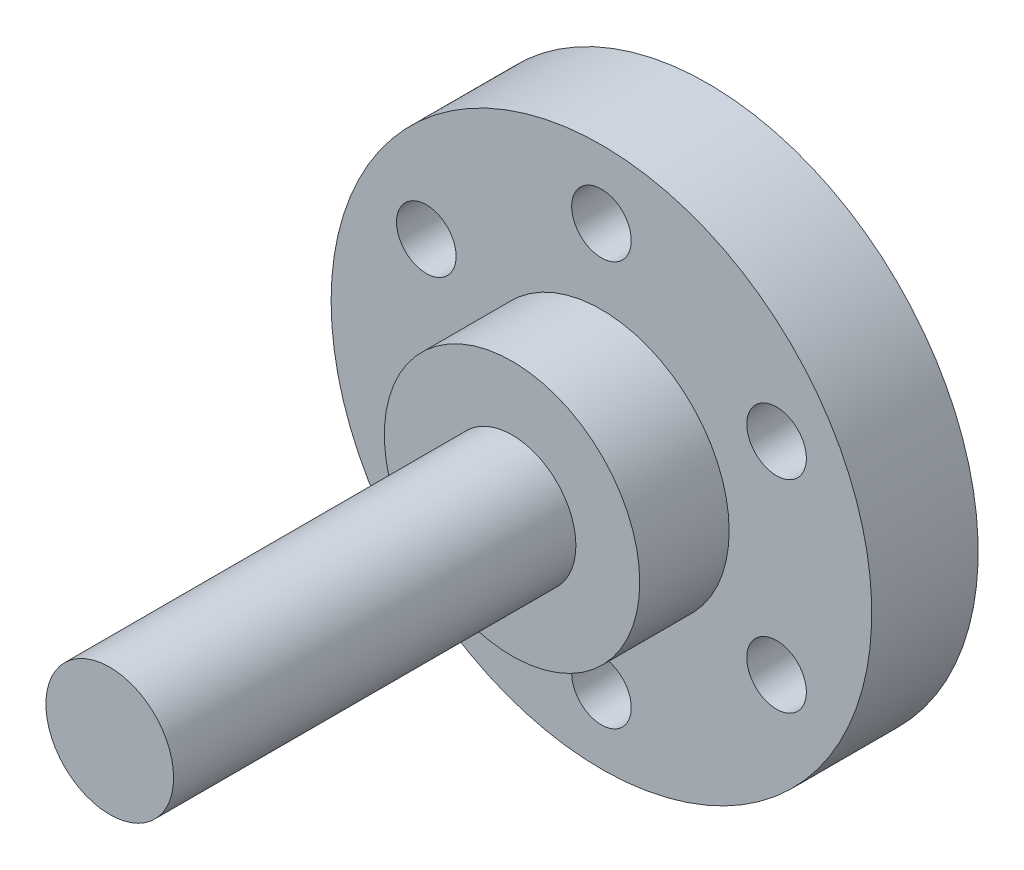
ISO-10303-21;
HEADER;
FILE_DESCRIPTION(('STEP AP214'),'2;1');
FILE_NAME('part.step','',(''),(''),'','','');
FILE_SCHEMA(('AUTOMOTIVE_DESIGN { 1 0 10303 214 1 1 1 1 }'));
ENDSEC;
DATA;
#1=APPLICATION_CONTEXT('core data for automotive mechanical design processes');
#2=APPLICATION_PROTOCOL_DEFINITION('international standard','automotive_design',2000,#1);
#3=PRODUCT_CONTEXT('',#1,'mechanical');
#4=PRODUCT('Part','Part','',(#3));
#5=PRODUCT_RELATED_PRODUCT_CATEGORY('part','',(#4));
#6=PRODUCT_DEFINITION_FORMATION('','',#4);
#7=PRODUCT_DEFINITION_CONTEXT('part definition',#1,'design');
#8=PRODUCT_DEFINITION('design','',#6,#7);
#9=PRODUCT_DEFINITION_SHAPE('','',#8);
#10=(LENGTH_UNIT() NAMED_UNIT(*) SI_UNIT(.MILLI.,.METRE.));
#11=(NAMED_UNIT(*) PLANE_ANGLE_UNIT() SI_UNIT($,.RADIAN.));
#12=(NAMED_UNIT(*) SI_UNIT($,.STERADIAN.) SOLID_ANGLE_UNIT());
#13=UNCERTAINTY_MEASURE_WITH_UNIT(LENGTH_MEASURE(1.E-05),#10,'distance_accuracy_value','');
#14=(GEOMETRIC_REPRESENTATION_CONTEXT(3) GLOBAL_UNCERTAINTY_ASSIGNED_CONTEXT((#13)) GLOBAL_UNIT_ASSIGNED_CONTEXT((#10,
#11,#12)) REPRESENTATION_CONTEXT('',''));
#15=CARTESIAN_POINT('',(0.,0.,0.));
#16=DIRECTION('',(0.,0.,1.));
#17=DIRECTION('',(1.,0.,0.));
#18=AXIS2_PLACEMENT_3D('',#15,#16,#17);
#19=CARTESIAN_POINT('',(0.,0.,5.9));
#20=DIRECTION('',(0.,0.,1.));
#21=DIRECTION('',(1.,0.,0.));
#22=AXIS2_PLACEMENT_3D('',#19,#20,#21);
#23=CYLINDRICAL_SURFACE('',#22,6.);
#24=CARTESIAN_POINT('',(0.,0.,5.9));
#25=DIRECTION('',(0.,0.,-1.));
#26=DIRECTION('',(-1.,0.,0.));
#27=AXIS2_PLACEMENT_3D('',#24,#25,#26);
#28=CIRCLE('',#27,6.);
#29=CARTESIAN_POINT('',(-6.,0.,5.9));
#30=VERTEX_POINT('',#29);
#31=EDGE_CURVE('E50',#30,#30,#28,.F.);
#32=ORIENTED_EDGE('',*,*,#31,.T.);
#33=EDGE_LOOP('',(#32));
#34=FACE_BOUND('',#33,.T.);
#35=CARTESIAN_POINT('',(0.,0.,10.1));
#36=DIRECTION('',(0.,0.,1.));
#37=DIRECTION('',(1.,0.,0.));
#38=AXIS2_PLACEMENT_3D('',#35,#36,#37);
#39=CIRCLE('',#38,6.);
#40=CARTESIAN_POINT('',(6.,0.,10.1));
#41=VERTEX_POINT('',#40);
#42=EDGE_CURVE('E66',#41,#41,#39,.T.);
#43=ORIENTED_EDGE('',*,*,#42,.F.);
#44=EDGE_LOOP('',(#43));
#45=FACE_BOUND('',#44,.T.);
#46=ADVANCED_FACE('F34',(#34,#45),#23,.T.);
#47=CARTESIAN_POINT('',(0.,0.,0.9));
#48=DIRECTION('',(0.,0.,-1.));
#49=DIRECTION('',(-1.,0.,0.));
#50=AXIS2_PLACEMENT_3D('',#47,#48,#49);
#51=PLANE('',#50);
#52=CARTESIAN_POINT('',(8.22724133595197,4.74999999999964,0.9));
#53=DIRECTION('',(0.,0.,-1.));
#54=DIRECTION('',(-1.,0.,0.));
#55=AXIS2_PLACEMENT_3D('',#52,#53,#54);
#56=CIRCLE('',#55,1.40000000000041);
#57=CARTESIAN_POINT('',(6.82724133595156,4.74999999999964,0.9));
#58=VERTEX_POINT('',#57);
#59=EDGE_CURVE('E100',#58,#58,#56,.T.);
#60=ORIENTED_EDGE('',*,*,#59,.F.);
#61=EDGE_LOOP('',(#60));
#62=FACE_BOUND('',#61,.T.);
#63=CARTESIAN_POINT('',(8.22724133595156,-4.75000000000035,0.9));
#64=DIRECTION('',(0.,0.,-1.));
#65=DIRECTION('',(-1.,0.,0.));
#66=AXIS2_PLACEMENT_3D('',#63,#64,#65);
#67=CIRCLE('',#66,1.40000000000077);
#68=CARTESIAN_POINT('',(6.82724133595079,-4.75000000000035,0.9));
#69=VERTEX_POINT('',#68);
#70=EDGE_CURVE('E94',#69,#69,#67,.T.);
#71=ORIENTED_EDGE('',*,*,#70,.F.);
#72=EDGE_LOOP('',(#71));
#73=FACE_BOUND('',#72,.T.);
#74=CARTESIAN_POINT('',(-8.07691889848134E-13,-9.5,0.9));
#75=DIRECTION('',(0.,0.,-1.));
#76=DIRECTION('',(-1.,0.,0.));
#77=AXIS2_PLACEMENT_3D('',#74,#75,#76);
#78=CIRCLE('',#77,1.40000000000084);
#79=CARTESIAN_POINT('',(-1.40000000000164,-9.5,0.9));
#80=VERTEX_POINT('',#79);
#81=EDGE_CURVE('E88',#80,#80,#78,.T.);
#82=ORIENTED_EDGE('',*,*,#81,.F.);
#83=EDGE_LOOP('',(#82));
#84=FACE_BOUND('',#83,.T.);
#85=CARTESIAN_POINT('',(-8.22724133595277,-4.74999999999965,0.9));
#86=DIRECTION('',(0.,0.,-1.));
#87=DIRECTION('',(-1.,0.,0.));
#88=AXIS2_PLACEMENT_3D('',#85,#86,#87);
#89=CIRCLE('',#88,1.40000000000052);
#90=CARTESIAN_POINT('',(-9.6272413359533,-4.74999999999965,0.9));
#91=VERTEX_POINT('',#90);
#92=EDGE_CURVE('E82',#91,#91,#89,.T.);
#93=ORIENTED_EDGE('',*,*,#92,.F.);
#94=EDGE_LOOP('',(#93));
#95=FACE_BOUND('',#94,.T.);
#96=CARTESIAN_POINT('',(-8.22724133595237,4.75000000000035,0.9));
#97=DIRECTION('',(0.,0.,-1.));
#98=DIRECTION('',(-1.,0.,0.));
#99=AXIS2_PLACEMENT_3D('',#96,#97,#98);
#100=CIRCLE('',#99,1.40000000000012);
#101=CARTESIAN_POINT('',(-9.62724133595248,4.75000000000035,0.9));
#102=VERTEX_POINT('',#101);
#103=EDGE_CURVE('E76',#102,#102,#100,.T.);
#104=ORIENTED_EDGE('',*,*,#103,.F.);
#105=EDGE_LOOP('',(#104));
#106=FACE_BOUND('',#105,.T.);
#107=CARTESIAN_POINT('',(0.,9.5,0.9));
#108=DIRECTION('',(0.,0.,-1.));
#109=DIRECTION('',(-1.,0.,0.));
#110=AXIS2_PLACEMENT_3D('',#107,#108,#109);
#111=CIRCLE('',#110,1.4);
#112=CARTESIAN_POINT('',(-1.4,9.5,0.9));
#113=VERTEX_POINT('',#112);
#114=EDGE_CURVE('E70',#113,#113,#111,.T.);
#115=ORIENTED_EDGE('',*,*,#114,.F.);
#116=EDGE_LOOP('',(#115));
#117=FACE_BOUND('',#116,.T.);
#118=CARTESIAN_POINT('',(0.,0.,0.9));
#119=DIRECTION('',(0.,0.,-1.));
#120=DIRECTION('',(-1.,0.,0.));
#121=AXIS2_PLACEMENT_3D('',#118,#119,#120);
#122=CIRCLE('',#121,12.7);
#123=CARTESIAN_POINT('',(-12.7,0.,0.9));
#124=VERTEX_POINT('',#123);
#125=EDGE_CURVE('E56',#124,#124,#122,.T.);
#126=ORIENTED_EDGE('',*,*,#125,.T.);
#127=EDGE_LOOP('',(#126));
#128=FACE_BOUND('',#127,.T.);
#129=CARTESIAN_POINT('',(0.,0.,0.900000000000001));
#130=DIRECTION('',(0.,0.,-1.));
#131=DIRECTION('',(-1.,0.,0.));
#132=AXIS2_PLACEMENT_3D('',#129,#130,#131);
#133=CIRCLE('',#132,3.);
#134=CARTESIAN_POINT('',(-3.,0.,0.900000000000001));
#135=VERTEX_POINT('',#134);
#136=EDGE_CURVE('E47',#135,#135,#133,.T.);
#137=ORIENTED_EDGE('',*,*,#136,.F.);
#138=EDGE_LOOP('',(#137));
#139=FACE_BOUND('',#138,.T.);
#140=ADVANCED_FACE('F116',(#62,#73,#84,#95,#106,#117,#128,#139),#51,.T.);
#141=CARTESIAN_POINT('',(0.,0.,0.9));
#142=DIRECTION('',(0.,0.,1.));
#143=DIRECTION('',(1.,0.,0.));
#144=AXIS2_PLACEMENT_3D('',#141,#142,#143);
#145=CYLINDRICAL_SURFACE('',#144,12.7);
#146=ORIENTED_EDGE('',*,*,#125,.F.);
#147=EDGE_LOOP('',(#146));
#148=FACE_BOUND('',#147,.T.);
#149=CARTESIAN_POINT('',(0.,0.,5.9));
#150=DIRECTION('',(0.,0.,-1.));
#151=DIRECTION('',(-1.,0.,0.));
#152=AXIS2_PLACEMENT_3D('',#149,#150,#151);
#153=CIRCLE('',#152,12.7);
#154=CARTESIAN_POINT('',(-12.7,0.,5.9));
#155=VERTEX_POINT('',#154);
#156=EDGE_CURVE('E60',#155,#155,#153,.T.);
#157=ORIENTED_EDGE('',*,*,#156,.T.);
#158=EDGE_LOOP('',(#157));
#159=FACE_BOUND('',#158,.T.);
#160=ADVANCED_FACE('F119',(#148,#159),#145,.T.);
#161=CARTESIAN_POINT('',(0.,0.,5.9));
#162=DIRECTION('',(0.,0.,-1.));
#163=DIRECTION('',(-1.,0.,0.));
#164=AXIS2_PLACEMENT_3D('',#161,#162,#163);
#165=PLANE('',#164);
#166=CARTESIAN_POINT('',(8.22724133595197,4.74999999999964,5.9));
#167=DIRECTION('',(0.,0.,-1.));
#168=DIRECTION('',(-1.,0.,0.));
#169=AXIS2_PLACEMENT_3D('',#166,#167,#168);
#170=CIRCLE('',#169,1.40000000000041);
#171=CARTESIAN_POINT('',(6.82724133595156,4.74999999999964,5.9));
#172=VERTEX_POINT('',#171);
#173=EDGE_CURVE('E97',#172,#172,#170,.T.);
#174=ORIENTED_EDGE('',*,*,#173,.T.);
#175=EDGE_LOOP('',(#174));
#176=FACE_BOUND('',#175,.T.);
#177=CARTESIAN_POINT('',(8.22724133595156,-4.75000000000035,5.9));
#178=DIRECTION('',(0.,0.,-1.));
#179=DIRECTION('',(-1.,0.,0.));
#180=AXIS2_PLACEMENT_3D('',#177,#178,#179);
#181=CIRCLE('',#180,1.40000000000077);
#182=CARTESIAN_POINT('',(6.82724133595079,-4.75000000000035,5.9));
#183=VERTEX_POINT('',#182);
#184=EDGE_CURVE('E91',#183,#183,#181,.T.);
#185=ORIENTED_EDGE('',*,*,#184,.T.);
#186=EDGE_LOOP('',(#185));
#187=FACE_BOUND('',#186,.T.);
#188=CARTESIAN_POINT('',(-8.07691889848134E-13,-9.5,5.9));
#189=DIRECTION('',(0.,0.,-1.));
#190=DIRECTION('',(-1.,0.,0.));
#191=AXIS2_PLACEMENT_3D('',#188,#189,#190);
#192=CIRCLE('',#191,1.40000000000084);
#193=CARTESIAN_POINT('',(-1.40000000000164,-9.5,5.9));
#194=VERTEX_POINT('',#193);
#195=EDGE_CURVE('E85',#194,#194,#192,.T.);
#196=ORIENTED_EDGE('',*,*,#195,.T.);
#197=EDGE_LOOP('',(#196));
#198=FACE_BOUND('',#197,.T.);
#199=CARTESIAN_POINT('',(-8.22724133595277,-4.74999999999965,5.9));
#200=DIRECTION('',(0.,0.,-1.));
#201=DIRECTION('',(-1.,0.,0.));
#202=AXIS2_PLACEMENT_3D('',#199,#200,#201);
#203=CIRCLE('',#202,1.40000000000052);
#204=CARTESIAN_POINT('',(-9.6272413359533,-4.74999999999965,5.9));
#205=VERTEX_POINT('',#204);
#206=EDGE_CURVE('E79',#205,#205,#203,.T.);
#207=ORIENTED_EDGE('',*,*,#206,.T.);
#208=EDGE_LOOP('',(#207));
#209=FACE_BOUND('',#208,.T.);
#210=CARTESIAN_POINT('',(-8.22724133595237,4.75000000000035,5.9));
#211=DIRECTION('',(0.,0.,-1.));
#212=DIRECTION('',(-1.,0.,0.));
#213=AXIS2_PLACEMENT_3D('',#210,#211,#212);
#214=CIRCLE('',#213,1.40000000000012);
#215=CARTESIAN_POINT('',(-9.62724133595248,4.75000000000035,5.9));
#216=VERTEX_POINT('',#215);
#217=EDGE_CURVE('E73',#216,#216,#214,.T.);
#218=ORIENTED_EDGE('',*,*,#217,.T.);
#219=EDGE_LOOP('',(#218));
#220=FACE_BOUND('',#219,.T.);
#221=CARTESIAN_POINT('',(0.,9.5,5.9));
#222=DIRECTION('',(0.,0.,-1.));
#223=DIRECTION('',(-1.,0.,0.));
#224=AXIS2_PLACEMENT_3D('',#221,#222,#223);
#225=CIRCLE('',#224,1.4);
#226=CARTESIAN_POINT('',(-1.4,9.5,5.9));
#227=VERTEX_POINT('',#226);
#228=EDGE_CURVE('E69',#227,#227,#225,.T.);
#229=ORIENTED_EDGE('',*,*,#228,.T.);
#230=EDGE_LOOP('',(#229));
#231=FACE_BOUND('',#230,.T.);
#232=ORIENTED_EDGE('',*,*,#31,.F.);
#233=EDGE_LOOP('',(#232));
#234=FACE_BOUND('',#233,.T.);
#235=ORIENTED_EDGE('',*,*,#156,.F.);
#236=EDGE_LOOP('',(#235));
#237=FACE_BOUND('',#236,.T.);
#238=ADVANCED_FACE('F106',(#176,#187,#198,#209,#220,#231,#234,#237),#165,.F.);
#239=CARTESIAN_POINT('',(0.,0.,0.));
#240=DIRECTION('',(0.,0.,1.));
#241=DIRECTION('',(1.,0.,0.));
#242=AXIS2_PLACEMENT_3D('',#239,#240,#241);
#243=PLANE('',#242);
#244=CARTESIAN_POINT('',(0.,0.,0.));
#245=DIRECTION('',(0.,0.,1.));
#246=DIRECTION('',(1.,0.,0.));
#247=AXIS2_PLACEMENT_3D('',#244,#245,#246);
#248=CIRCLE('',#247,3.);
#249=CARTESIAN_POINT('',(3.,0.,0.));
#250=VERTEX_POINT('',#249);
#251=EDGE_CURVE('E42',#250,#250,#248,.T.);
#252=ORIENTED_EDGE('',*,*,#251,.F.);
#253=EDGE_LOOP('',(#252));
#254=FACE_BOUND('',#253,.T.);
#255=ADVANCED_FACE('F159',(#254),#243,.F.);
#256=CARTESIAN_POINT('',(0.,0.,29.));
#257=DIRECTION('',(0.,0.,-1.));
#258=DIRECTION('',(-1.,0.,0.));
#259=AXIS2_PLACEMENT_3D('',#256,#257,#258);
#260=CYLINDRICAL_SURFACE('',#259,3.);
#261=ORIENTED_EDGE('',*,*,#136,.T.);
#262=EDGE_LOOP('',(#261));
#263=FACE_BOUND('',#262,.T.);
#264=ORIENTED_EDGE('',*,*,#251,.T.);
#265=EDGE_LOOP('',(#264));
#266=FACE_BOUND('',#265,.T.);
#267=ADVANCED_FACE('F146',(#263,#266),#260,.T.);
#268=CARTESIAN_POINT('',(0.,0.,10.1));
#269=DIRECTION('',(0.,0.,1.));
#270=DIRECTION('',(1.,0.,0.));
#271=AXIS2_PLACEMENT_3D('',#268,#269,#270);
#272=PLANE('',#271);
#273=ORIENTED_EDGE('',*,*,#42,.T.);
#274=EDGE_LOOP('',(#273));
#275=FACE_BOUND('',#274,.T.);
#276=CARTESIAN_POINT('',(0.,0.,10.1));
#277=DIRECTION('',(0.,0.,1.));
#278=DIRECTION('',(1.,0.,0.));
#279=AXIS2_PLACEMENT_3D('',#276,#277,#278);
#280=CIRCLE('',#279,3.);
#281=CARTESIAN_POINT('',(3.,0.,10.1));
#282=VERTEX_POINT('',#281);
#283=EDGE_CURVE('E38',#282,#282,#280,.T.);
#284=ORIENTED_EDGE('',*,*,#283,.F.);
#285=EDGE_LOOP('',(#284));
#286=FACE_BOUND('',#285,.T.);
#287=ADVANCED_FACE('F158',(#275,#286),#272,.T.);
#288=CARTESIAN_POINT('',(0.,0.,29.));
#289=DIRECTION('',(0.,0.,1.));
#290=DIRECTION('',(1.,0.,0.));
#291=AXIS2_PLACEMENT_3D('',#288,#289,#290);
#292=PLANE('',#291);
#293=CARTESIAN_POINT('',(0.,0.,29.));
#294=DIRECTION('',(0.,0.,1.));
#295=DIRECTION('',(1.,0.,0.));
#296=AXIS2_PLACEMENT_3D('',#293,#294,#295);
#297=CIRCLE('',#296,3.);
#298=CARTESIAN_POINT('',(3.,0.,29.));
#299=VERTEX_POINT('',#298);
#300=EDGE_CURVE('E10',#299,#299,#297,.T.);
#301=ORIENTED_EDGE('',*,*,#300,.T.);
#302=EDGE_LOOP('',(#301));
#303=FACE_BOUND('',#302,.T.);
#304=ADVANCED_FACE('F144',(#303),#292,.T.);
#305=ORIENTED_EDGE('',*,*,#283,.T.);
#306=EDGE_LOOP('',(#305));
#307=FACE_BOUND('',#306,.T.);
#308=ORIENTED_EDGE('',*,*,#300,.F.);
#309=EDGE_LOOP('',(#308));
#310=FACE_BOUND('',#309,.T.);
#311=ADVANCED_FACE('F36',(#307,#310),#260,.T.);
#312=CARTESIAN_POINT('',(0.,9.5,5.9));
#313=DIRECTION('',(0.,0.,-1.));
#314=DIRECTION('',(-1.,0.,0.));
#315=AXIS2_PLACEMENT_3D('',#312,#313,#314);
#316=CYLINDRICAL_SURFACE('',#315,1.4);
#317=ORIENTED_EDGE('',*,*,#228,.F.);
#318=EDGE_LOOP('',(#317));
#319=FACE_BOUND('',#318,.T.);
#320=ORIENTED_EDGE('',*,*,#114,.T.);
#321=EDGE_LOOP('',(#320));
#322=FACE_BOUND('',#321,.T.);
#323=ADVANCED_FACE('F132',(#319,#322),#316,.F.);
#324=CARTESIAN_POINT('',(-8.22724133595237,4.75000000000035,5.9));
#325=DIRECTION('',(0.,0.,-1.));
#326=DIRECTION('',(-1.,0.,0.));
#327=AXIS2_PLACEMENT_3D('',#324,#325,#326);
#328=CYLINDRICAL_SURFACE('',#327,1.40000000000012);
#329=ORIENTED_EDGE('',*,*,#217,.F.);
#330=EDGE_LOOP('',(#329));
#331=FACE_BOUND('',#330,.T.);
#332=ORIENTED_EDGE('',*,*,#103,.T.);
#333=EDGE_LOOP('',(#332));
#334=FACE_BOUND('',#333,.T.);
#335=ADVANCED_FACE('F134',(#331,#334),#328,.F.);
#336=CARTESIAN_POINT('',(-8.22724133595277,-4.74999999999965,5.9));
#337=DIRECTION('',(0.,0.,-1.));
#338=DIRECTION('',(-1.,0.,0.));
#339=AXIS2_PLACEMENT_3D('',#336,#337,#338);
#340=CYLINDRICAL_SURFACE('',#339,1.40000000000052);
#341=ORIENTED_EDGE('',*,*,#206,.F.);
#342=EDGE_LOOP('',(#341));
#343=FACE_BOUND('',#342,.T.);
#344=ORIENTED_EDGE('',*,*,#92,.T.);
#345=EDGE_LOOP('',(#344));
#346=FACE_BOUND('',#345,.T.);
#347=ADVANCED_FACE('F141',(#343,#346),#340,.F.);
#348=CARTESIAN_POINT('',(-8.07691889848134E-13,-9.5,5.9));
#349=DIRECTION('',(0.,0.,-1.));
#350=DIRECTION('',(-1.,0.,0.));
#351=AXIS2_PLACEMENT_3D('',#348,#349,#350);
#352=CYLINDRICAL_SURFACE('',#351,1.40000000000084);
#353=ORIENTED_EDGE('',*,*,#195,.F.);
#354=EDGE_LOOP('',(#353));
#355=FACE_BOUND('',#354,.T.);
#356=ORIENTED_EDGE('',*,*,#81,.T.);
#357=EDGE_LOOP('',(#356));
#358=FACE_BOUND('',#357,.T.);
#359=ADVANCED_FACE('F223',(#355,#358),#352,.F.);
#360=CARTESIAN_POINT('',(8.22724133595156,-4.75000000000035,5.9));
#361=DIRECTION('',(0.,0.,-1.));
#362=DIRECTION('',(-1.,0.,0.));
#363=AXIS2_PLACEMENT_3D('',#360,#361,#362);
#364=CYLINDRICAL_SURFACE('',#363,1.40000000000077);
#365=ORIENTED_EDGE('',*,*,#184,.F.);
#366=EDGE_LOOP('',(#365));
#367=FACE_BOUND('',#366,.T.);
#368=ORIENTED_EDGE('',*,*,#70,.T.);
#369=EDGE_LOOP('',(#368));
#370=FACE_BOUND('',#369,.T.);
#371=ADVANCED_FACE('F112',(#367,#370),#364,.F.);
#372=CARTESIAN_POINT('',(8.22724133595197,4.74999999999964,5.9));
#373=DIRECTION('',(0.,0.,-1.));
#374=DIRECTION('',(-1.,0.,0.));
#375=AXIS2_PLACEMENT_3D('',#372,#373,#374);
#376=CYLINDRICAL_SURFACE('',#375,1.40000000000041);
#377=ORIENTED_EDGE('',*,*,#173,.F.);
#378=EDGE_LOOP('',(#377));
#379=FACE_BOUND('',#378,.T.);
#380=ORIENTED_EDGE('',*,*,#59,.T.);
#381=EDGE_LOOP('',(#380));
#382=FACE_BOUND('',#381,.T.);
#383=ADVANCED_FACE('F109',(#379,#382),#376,.F.);
#384=CLOSED_SHELL('',(#46,#140,#160,#238,#255,#267,#287,#304,#311,#323,#335,#347,#359,#371,#383));
#385=MANIFOLD_SOLID_BREP('B2',#384);
#386=ADVANCED_BREP_SHAPE_REPRESENTATION('',(#18,#385),#14);
#387=SHAPE_DEFINITION_REPRESENTATION(#9,#386);
ENDSEC;
END-ISO-10303-21;
